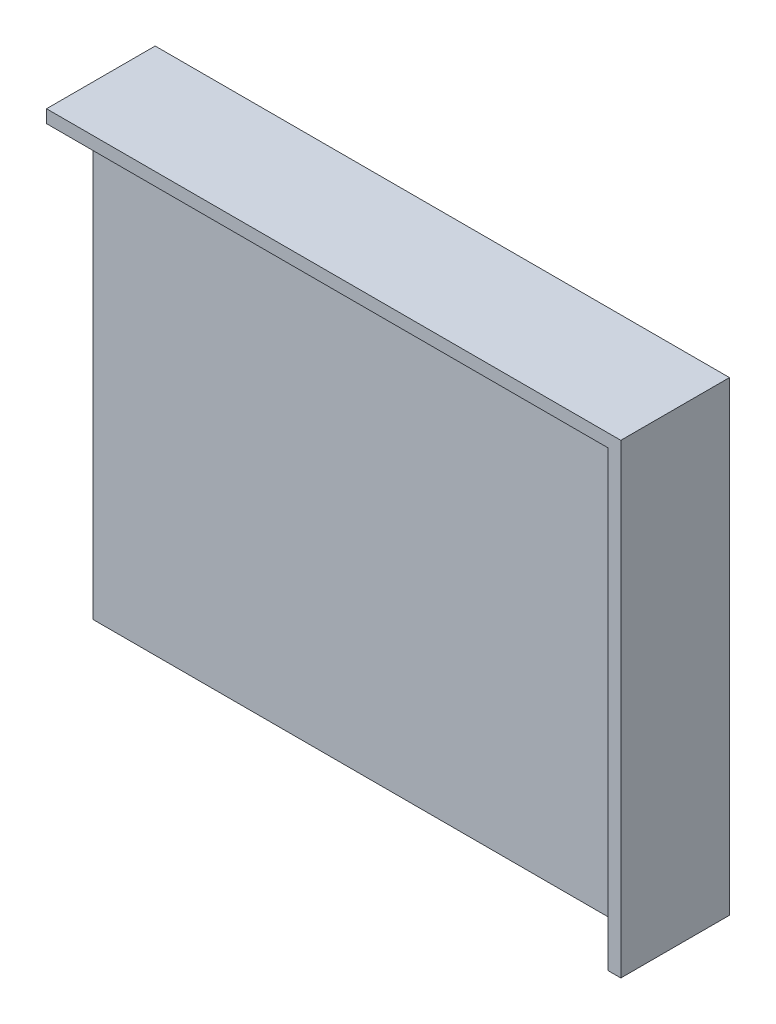
ISO-10303-21;
HEADER;
FILE_DESCRIPTION(('STEP AP214'),'2;1');
FILE_NAME('part.step','',(''),(''),'','','');
FILE_SCHEMA(('AUTOMOTIVE_DESIGN { 1 0 10303 214 1 1 1 1 }'));
ENDSEC;
DATA;
#1=APPLICATION_CONTEXT('core data for automotive mechanical design processes');
#2=APPLICATION_PROTOCOL_DEFINITION('international standard','automotive_design',2000,#1);
#3=PRODUCT_CONTEXT('',#1,'mechanical');
#4=PRODUCT('Part','Part','',(#3));
#5=PRODUCT_RELATED_PRODUCT_CATEGORY('part','',(#4));
#6=PRODUCT_DEFINITION_FORMATION('','',#4);
#7=PRODUCT_DEFINITION_CONTEXT('part definition',#1,'design');
#8=PRODUCT_DEFINITION('design','',#6,#7);
#9=PRODUCT_DEFINITION_SHAPE('','',#8);
#10=(LENGTH_UNIT() NAMED_UNIT(*) SI_UNIT(.MILLI.,.METRE.));
#11=(NAMED_UNIT(*) PLANE_ANGLE_UNIT() SI_UNIT($,.RADIAN.));
#12=(NAMED_UNIT(*) SI_UNIT($,.STERADIAN.) SOLID_ANGLE_UNIT());
#13=UNCERTAINTY_MEASURE_WITH_UNIT(LENGTH_MEASURE(1.E-05),#10,'distance_accuracy_value','');
#14=(GEOMETRIC_REPRESENTATION_CONTEXT(3) GLOBAL_UNCERTAINTY_ASSIGNED_CONTEXT((#13)) GLOBAL_UNIT_ASSIGNED_CONTEXT((#10,
#11,#12)) REPRESENTATION_CONTEXT('',''));
#15=CARTESIAN_POINT('',(0.,0.,0.));
#16=DIRECTION('',(0.,0.,1.));
#17=DIRECTION('',(1.,0.,0.));
#18=AXIS2_PLACEMENT_3D('',#15,#16,#17);
#19=CARTESIAN_POINT('',(213.576829268293,16.3396341463416,26.68));
#20=DIRECTION('',(0.,-1.,0.));
#21=DIRECTION('',(1.,0.,0.));
#22=AXIS2_PLACEMENT_3D('',#19,#20,#21);
#23=PLANE('',#22);
#24=DIRECTION('',(1.,0.,0.));
#25=VECTOR('',#24,1.);
#26=CARTESIAN_POINT('',(0.,16.3396341463416,2.54));
#27=LINE('',#26,#25);
#28=CARTESIAN_POINT('',(72.6068292682926,16.3396341463416,2.54));
#29=VERTEX_POINT('',#28);
#30=CARTESIAN_POINT('',(211.036829268293,16.3396341463416,2.54));
#31=VERTEX_POINT('',#30);
#32=EDGE_CURVE('E141',#29,#31,#27,.T.);
#33=ORIENTED_EDGE('',*,*,#32,.F.);
#34=DIRECTION('',(0.,0.,-1.));
#35=VECTOR('',#34,1.);
#36=CARTESIAN_POINT('',(72.6068292682926,16.3396341463416,26.68));
#37=LINE('',#36,#35);
#38=CARTESIAN_POINT('',(72.6068292682926,16.3396341463416,0.));
#39=VERTEX_POINT('',#38);
#40=EDGE_CURVE('E142',#29,#39,#37,.T.);
#41=ORIENTED_EDGE('',*,*,#40,.T.);
#42=DIRECTION('',(1.,0.,0.));
#43=VECTOR('',#42,1.);
#44=CARTESIAN_POINT('',(0.,16.3396341463416,0.));
#45=LINE('',#44,#43);
#46=CARTESIAN_POINT('',(213.576829268293,16.3396341463416,0.));
#47=VERTEX_POINT('',#46);
#48=EDGE_CURVE('E147',#39,#47,#45,.T.);
#49=ORIENTED_EDGE('',*,*,#48,.T.);
#50=DIRECTION('',(0.,0.,-1.));
#51=VECTOR('',#50,1.);
#52=CARTESIAN_POINT('',(213.576829268293,16.3396341463416,28.702));
#53=LINE('',#52,#51);
#54=CARTESIAN_POINT('',(213.576829268293,16.3396341463415,26.67));
#55=VERTEX_POINT('',#54);
#56=EDGE_CURVE('E181',#55,#47,#53,.T.);
#57=ORIENTED_EDGE('',*,*,#56,.F.);
#58=DIRECTION('',(1.,0.,0.));
#59=VECTOR('',#58,1.);
#60=CARTESIAN_POINT('',(0.,16.3396341463416,26.67));
#61=LINE('',#60,#59);
#62=CARTESIAN_POINT('',(210.401829268293,16.3396341463416,26.67));
#63=VERTEX_POINT('',#62);
#64=EDGE_CURVE('E156',#63,#55,#61,.T.);
#65=ORIENTED_EDGE('',*,*,#64,.F.);
#66=DIRECTION('',(0.,0.,1.));
#67=VECTOR('',#66,1.);
#68=CARTESIAN_POINT('',(210.401829268293,16.3396341463416,0.));
#69=LINE('',#68,#67);
#70=CARTESIAN_POINT('',(210.401829268293,16.3396341463416,15.24));
#71=VERTEX_POINT('',#70);
#72=EDGE_CURVE('E146',#71,#63,#69,.T.);
#73=ORIENTED_EDGE('',*,*,#72,.F.);
#74=DIRECTION('',(-1.,0.,0.));
#75=VECTOR('',#74,1.);
#76=CARTESIAN_POINT('',(0.,16.3396341463416,15.24));
#77=LINE('',#76,#75);
#78=CARTESIAN_POINT('',(72.6068292682926,16.3396341463416,15.24));
#79=VERTEX_POINT('',#78);
#80=EDGE_CURVE('E127',#71,#79,#77,.T.);
#81=ORIENTED_EDGE('',*,*,#80,.T.);
#82=CARTESIAN_POINT('',(72.6068292682926,16.3396341463416,12.7));
#83=VERTEX_POINT('',#82);
#84=EDGE_CURVE('E136',#79,#83,#37,.T.);
#85=ORIENTED_EDGE('',*,*,#84,.T.);
#86=DIRECTION('',(-1.,0.,0.));
#87=VECTOR('',#86,1.);
#88=CARTESIAN_POINT('',(0.,16.3396341463416,12.7));
#89=LINE('',#88,#87);
#90=CARTESIAN_POINT('',(211.036829268293,16.3396341463416,12.7));
#91=VERTEX_POINT('',#90);
#92=EDGE_CURVE('E184',#91,#83,#89,.T.);
#93=ORIENTED_EDGE('',*,*,#92,.F.);
#94=DIRECTION('',(0.,0.,-1.));
#95=VECTOR('',#94,1.);
#96=CARTESIAN_POINT('',(211.036829268293,16.3396341463416,28.702));
#97=LINE('',#96,#95);
#98=EDGE_CURVE('E150',#91,#31,#97,.T.);
#99=ORIENTED_EDGE('',*,*,#98,.T.);
#100=EDGE_LOOP('',(#33,#41,#49,#57,#65,#73,#81,#85,#93,#99));
#101=FACE_BOUND('',#100,.T.);
#102=ADVANCED_FACE('F40',(#101),#23,.T.);
#103=CARTESIAN_POINT('',(-68.3631707317074,128.099634146342,25.4));
#104=DIRECTION('',(0.,-1.,0.));
#105=DIRECTION('',(1.,0.,0.));
#106=AXIS2_PLACEMENT_3D('',#103,#104,#105);
#107=PLANE('',#106);
#108=DIRECTION('',(0.,0.,1.));
#109=VECTOR('',#108,1.);
#110=CARTESIAN_POINT('',(72.6068292682926,128.099634146342,25.4));
#111=LINE('',#110,#109);
#112=CARTESIAN_POINT('',(72.6068292682926,128.099634146342,2.54));
#113=VERTEX_POINT('',#112);
#114=CARTESIAN_POINT('',(72.6068292682926,128.099634146342,12.7));
#115=VERTEX_POINT('',#114);
#116=EDGE_CURVE('E158',#113,#115,#111,.T.);
#117=ORIENTED_EDGE('',*,*,#116,.F.);
#118=DIRECTION('',(-1.,0.,0.));
#119=VECTOR('',#118,1.);
#120=CARTESIAN_POINT('',(-68.3631707317074,128.099634146342,2.54));
#121=LINE('',#120,#119);
#122=CARTESIAN_POINT('',(211.036829268293,128.099634146342,2.54));
#123=VERTEX_POINT('',#122);
#124=EDGE_CURVE('E200',#123,#113,#121,.T.);
#125=ORIENTED_EDGE('',*,*,#124,.F.);
#126=DIRECTION('',(0.,0.,-1.));
#127=VECTOR('',#126,1.);
#128=CARTESIAN_POINT('',(211.036829268293,128.099634146342,28.702));
#129=LINE('',#128,#127);
#130=CARTESIAN_POINT('',(211.036829268293,128.099634146342,12.7));
#131=VERTEX_POINT('',#130);
#132=EDGE_CURVE('E164',#131,#123,#129,.T.);
#133=ORIENTED_EDGE('',*,*,#132,.F.);
#134=DIRECTION('',(-1.,0.,0.));
#135=VECTOR('',#134,1.);
#136=CARTESIAN_POINT('',(0.,128.099634146342,12.7));
#137=LINE('',#136,#135);
#138=EDGE_CURVE('E131',#131,#115,#137,.T.);
#139=ORIENTED_EDGE('',*,*,#138,.T.);
#140=EDGE_LOOP('',(#117,#125,#133,#139));
#141=FACE_BOUND('',#140,.T.);
#142=ADVANCED_FACE('F204',(#141),#107,.T.);
#143=CARTESIAN_POINT('',(0.,127.464634146342,0.));
#144=DIRECTION('',(0.,-1.,0.));
#145=DIRECTION('',(1.,0.,0.));
#146=AXIS2_PLACEMENT_3D('',#143,#144,#145);
#147=PLANE('',#146);
#148=DIRECTION('',(0.,0.,1.));
#149=VECTOR('',#148,1.);
#150=CARTESIAN_POINT('',(72.6068292682926,127.464634146342,0.));
#151=LINE('',#150,#149);
#152=CARTESIAN_POINT('',(72.6068292682926,127.464634146342,15.24));
#153=VERTEX_POINT('',#152);
#154=CARTESIAN_POINT('',(72.6068292682926,127.464634146342,26.67));
#155=VERTEX_POINT('',#154);
#156=EDGE_CURVE('E209',#153,#155,#151,.T.);
#157=ORIENTED_EDGE('',*,*,#156,.F.);
#158=DIRECTION('',(-1.,0.,0.));
#159=VECTOR('',#158,1.);
#160=CARTESIAN_POINT('',(-65.1881707317074,127.464634146342,15.24));
#161=LINE('',#160,#159);
#162=CARTESIAN_POINT('',(210.401829268293,127.464634146342,15.24));
#163=VERTEX_POINT('',#162);
#164=EDGE_CURVE('E129',#163,#153,#161,.T.);
#165=ORIENTED_EDGE('',*,*,#164,.F.);
#166=DIRECTION('',(0.,0.,1.));
#167=VECTOR('',#166,1.);
#168=CARTESIAN_POINT('',(210.401829268293,127.464634146342,36.83));
#169=LINE('',#168,#167);
#170=CARTESIAN_POINT('',(210.401829268293,127.464634146342,26.67));
#171=VERTEX_POINT('',#170);
#172=EDGE_CURVE('E170',#163,#171,#169,.T.);
#173=ORIENTED_EDGE('',*,*,#172,.T.);
#174=DIRECTION('',(1.,0.,0.));
#175=VECTOR('',#174,1.);
#176=CARTESIAN_POINT('',(-65.1881707317074,127.464634146342,26.67));
#177=LINE('',#176,#175);
#178=EDGE_CURVE('E11',#155,#171,#177,.T.);
#179=ORIENTED_EDGE('',*,*,#178,.F.);
#180=EDGE_LOOP('',(#157,#165,#173,#179));
#181=FACE_BOUND('',#180,.T.);
#182=ADVANCED_FACE('F223',(#181),#147,.T.);
#183=CARTESIAN_POINT('',(72.6068292682926,130.639634146342,26.68));
#184=DIRECTION('',(1.,0.,0.));
#185=DIRECTION('',(0.,1.,0.));
#186=AXIS2_PLACEMENT_3D('',#183,#184,#185);
#187=PLANE('',#186);
#188=ORIENTED_EDGE('',*,*,#84,.F.);
#189=DIRECTION('',(0.,-1.,0.));
#190=VECTOR('',#189,1.);
#191=CARTESIAN_POINT('',(72.6068292682926,0.,15.24));
#192=LINE('',#191,#190);
#193=EDGE_CURVE('E123',#153,#79,#192,.T.);
#194=ORIENTED_EDGE('',*,*,#193,.F.);
#195=ORIENTED_EDGE('',*,*,#156,.T.);
#196=DIRECTION('',(0.,1.,0.));
#197=VECTOR('',#196,1.);
#198=CARTESIAN_POINT('',(72.6068292682926,0.,26.67));
#199=LINE('',#198,#197);
#200=CARTESIAN_POINT('',(72.6068292682926,130.639634146342,26.67));
#201=VERTEX_POINT('',#200);
#202=EDGE_CURVE('E206',#155,#201,#199,.T.);
#203=ORIENTED_EDGE('',*,*,#202,.T.);
#204=DIRECTION('',(0.,0.,1.));
#205=VECTOR('',#204,1.);
#206=CARTESIAN_POINT('',(72.6068292682926,130.639634146342,25.4));
#207=LINE('',#206,#205);
#208=CARTESIAN_POINT('',(72.6068292682926,130.639634146342,0.));
#209=VERTEX_POINT('',#208);
#210=EDGE_CURVE('E159',#209,#201,#207,.T.);
#211=ORIENTED_EDGE('',*,*,#210,.F.);
#212=DIRECTION('',(0.,1.,0.));
#213=VECTOR('',#212,1.);
#214=CARTESIAN_POINT('',(72.6068292682926,0.,0.));
#215=LINE('',#214,#213);
#216=EDGE_CURVE('E132',#39,#209,#215,.T.);
#217=ORIENTED_EDGE('',*,*,#216,.F.);
#218=ORIENTED_EDGE('',*,*,#40,.F.);
#219=DIRECTION('',(0.,1.,0.));
#220=VECTOR('',#219,1.);
#221=CARTESIAN_POINT('',(72.6068292682926,0.,2.54));
#222=LINE('',#221,#220);
#223=EDGE_CURVE('E155',#29,#113,#222,.T.);
#224=ORIENTED_EDGE('',*,*,#223,.T.);
#225=ORIENTED_EDGE('',*,*,#116,.T.);
#226=DIRECTION('',(0.,-1.,0.));
#227=VECTOR('',#226,1.);
#228=CARTESIAN_POINT('',(72.6068292682926,0.,12.7));
#229=LINE('',#228,#227);
#230=EDGE_CURVE('E139',#115,#83,#229,.T.);
#231=ORIENTED_EDGE('',*,*,#230,.T.);
#232=EDGE_LOOP('',(#188,#194,#195,#203,#211,#217,#218,#224,#225,#231));
#233=FACE_BOUND('',#232,.T.);
#234=ADVANCED_FACE('F137',(#233),#187,.F.);
#235=CARTESIAN_POINT('',(-68.3631707317074,130.639634146342,25.4));
#236=DIRECTION('',(0.,-1.,0.));
#237=DIRECTION('',(1.,0.,0.));
#238=AXIS2_PLACEMENT_3D('',#235,#236,#237);
#239=PLANE('',#238);
#240=DIRECTION('',(-1.,0.,0.));
#241=VECTOR('',#240,1.);
#242=CARTESIAN_POINT('',(-68.3631707317074,130.639634146342,0.));
#243=LINE('',#242,#241);
#244=CARTESIAN_POINT('',(213.576829268293,130.639634146342,0.));
#245=VERTEX_POINT('',#244);
#246=EDGE_CURVE('E171',#245,#209,#243,.T.);
#247=ORIENTED_EDGE('',*,*,#246,.T.);
#248=ORIENTED_EDGE('',*,*,#210,.T.);
#249=DIRECTION('',(-1.,0.,0.));
#250=VECTOR('',#249,1.);
#251=CARTESIAN_POINT('',(213.576829268293,130.639634146342,26.67));
#252=LINE('',#251,#250);
#253=CARTESIAN_POINT('',(213.576829268293,130.639634146342,26.67));
#254=VERTEX_POINT('',#253);
#255=EDGE_CURVE('E172',#254,#201,#252,.T.);
#256=ORIENTED_EDGE('',*,*,#255,.F.);
#257=DIRECTION('',(0.,0.,-1.));
#258=VECTOR('',#257,1.);
#259=CARTESIAN_POINT('',(213.576829268293,130.639634146342,25.4));
#260=LINE('',#259,#258);
#261=EDGE_CURVE('E167',#254,#245,#260,.T.);
#262=ORIENTED_EDGE('',*,*,#261,.T.);
#263=EDGE_LOOP('',(#247,#248,#256,#262));
#264=FACE_BOUND('',#263,.T.);
#265=ADVANCED_FACE('F231',(#264),#239,.F.);
#266=CARTESIAN_POINT('',(213.576829268293,-94.7853658536585,28.702));
#267=DIRECTION('',(1.,0.,0.));
#268=DIRECTION('',(0.,0.,-1.));
#269=AXIS2_PLACEMENT_3D('',#266,#267,#268);
#270=PLANE('',#269);
#271=DIRECTION('',(0.,1.,0.));
#272=VECTOR('',#271,1.);
#273=CARTESIAN_POINT('',(213.576829268293,-80.4343658536585,26.67));
#274=LINE('',#273,#272);
#275=EDGE_CURVE('E56',#55,#254,#274,.T.);
#276=ORIENTED_EDGE('',*,*,#275,.F.);
#277=ORIENTED_EDGE('',*,*,#56,.T.);
#278=DIRECTION('',(0.,1.,0.));
#279=VECTOR('',#278,1.);
#280=CARTESIAN_POINT('',(213.576829268293,130.639634146342,0.));
#281=LINE('',#280,#279);
#282=EDGE_CURVE('E168',#47,#245,#281,.T.);
#283=ORIENTED_EDGE('',*,*,#282,.T.);
#284=ORIENTED_EDGE('',*,*,#261,.F.);
#285=EDGE_LOOP('',(#276,#277,#283,#284));
#286=FACE_BOUND('',#285,.T.);
#287=ADVANCED_FACE('F237',(#286),#270,.T.);
#288=CARTESIAN_POINT('',(210.401829268293,0.,0.));
#289=DIRECTION('',(-1.,0.,0.));
#290=DIRECTION('',(0.,0.,1.));
#291=AXIS2_PLACEMENT_3D('',#288,#289,#290);
#292=PLANE('',#291);
#293=DIRECTION('',(0.,1.,0.));
#294=VECTOR('',#293,1.);
#295=CARTESIAN_POINT('',(210.401829268293,127.464634146342,15.24));
#296=LINE('',#295,#294);
#297=EDGE_CURVE('E64',#71,#163,#296,.T.);
#298=ORIENTED_EDGE('',*,*,#297,.F.);
#299=ORIENTED_EDGE('',*,*,#72,.T.);
#300=DIRECTION('',(0.,-1.,0.));
#301=VECTOR('',#300,1.);
#302=CARTESIAN_POINT('',(210.401829268293,127.464634146342,26.67));
#303=LINE('',#302,#301);
#304=EDGE_CURVE('E44',#171,#63,#303,.T.);
#305=ORIENTED_EDGE('',*,*,#304,.F.);
#306=ORIENTED_EDGE('',*,*,#172,.F.);
#307=EDGE_LOOP('',(#298,#299,#305,#306));
#308=FACE_BOUND('',#307,.T.);
#309=ADVANCED_FACE('F226',(#308),#292,.T.);
#310=CARTESIAN_POINT('',(0.,0.,26.67));
#311=DIRECTION('',(0.,0.,1.));
#312=DIRECTION('',(1.,0.,0.));
#313=AXIS2_PLACEMENT_3D('',#310,#311,#312);
#314=PLANE('',#313);
#315=ORIENTED_EDGE('',*,*,#304,.T.);
#316=ORIENTED_EDGE('',*,*,#64,.T.);
#317=ORIENTED_EDGE('',*,*,#275,.T.);
#318=ORIENTED_EDGE('',*,*,#255,.T.);
#319=ORIENTED_EDGE('',*,*,#202,.F.);
#320=ORIENTED_EDGE('',*,*,#178,.T.);
#321=EDGE_LOOP('',(#315,#316,#317,#318,#319,#320));
#322=FACE_BOUND('',#321,.T.);
#323=ADVANCED_FACE('F42',(#322),#314,.T.);
#324=CARTESIAN_POINT('',(0.,0.,15.24));
#325=DIRECTION('',(0.,0.,-1.));
#326=DIRECTION('',(-1.,0.,0.));
#327=AXIS2_PLACEMENT_3D('',#324,#325,#326);
#328=PLANE('',#327);
#329=ORIENTED_EDGE('',*,*,#80,.F.);
#330=ORIENTED_EDGE('',*,*,#297,.T.);
#331=ORIENTED_EDGE('',*,*,#164,.T.);
#332=ORIENTED_EDGE('',*,*,#193,.T.);
#333=EDGE_LOOP('',(#329,#330,#331,#332));
#334=FACE_BOUND('',#333,.T.);
#335=ADVANCED_FACE('F125',(#334),#328,.F.);
#336=CARTESIAN_POINT('',(0.,0.,0.));
#337=DIRECTION('',(0.,0.,1.));
#338=DIRECTION('',(1.,0.,0.));
#339=AXIS2_PLACEMENT_3D('',#336,#337,#338);
#340=PLANE('',#339);
#341=ORIENTED_EDGE('',*,*,#48,.F.);
#342=ORIENTED_EDGE('',*,*,#216,.T.);
#343=ORIENTED_EDGE('',*,*,#246,.F.);
#344=ORIENTED_EDGE('',*,*,#282,.F.);
#345=EDGE_LOOP('',(#341,#342,#343,#344));
#346=FACE_BOUND('',#345,.T.);
#347=ADVANCED_FACE('F235',(#346),#340,.F.);
#348=CARTESIAN_POINT('',(211.036829268293,-94.7853658536585,28.702));
#349=DIRECTION('',(1.,0.,0.));
#350=DIRECTION('',(0.,0.,-1.));
#351=AXIS2_PLACEMENT_3D('',#348,#349,#350);
#352=PLANE('',#351);
#353=ORIENTED_EDGE('',*,*,#98,.F.);
#354=DIRECTION('',(0.,-1.,0.));
#355=VECTOR('',#354,1.);
#356=CARTESIAN_POINT('',(211.036829268293,0.,12.7));
#357=LINE('',#356,#355);
#358=EDGE_CURVE('E163',#131,#91,#357,.T.);
#359=ORIENTED_EDGE('',*,*,#358,.F.);
#360=ORIENTED_EDGE('',*,*,#132,.T.);
#361=DIRECTION('',(0.,1.,0.));
#362=VECTOR('',#361,1.);
#363=CARTESIAN_POINT('',(211.036829268293,0.,2.54));
#364=LINE('',#363,#362);
#365=EDGE_CURVE('E161',#31,#123,#364,.T.);
#366=ORIENTED_EDGE('',*,*,#365,.F.);
#367=EDGE_LOOP('',(#353,#359,#360,#366));
#368=FACE_BOUND('',#367,.T.);
#369=ADVANCED_FACE('F193',(#368),#352,.F.);
#370=CARTESIAN_POINT('',(0.,0.,12.7));
#371=DIRECTION('',(0.,0.,-1.));
#372=DIRECTION('',(-1.,0.,0.));
#373=AXIS2_PLACEMENT_3D('',#370,#371,#372);
#374=PLANE('',#373);
#375=ORIENTED_EDGE('',*,*,#358,.T.);
#376=ORIENTED_EDGE('',*,*,#92,.T.);
#377=ORIENTED_EDGE('',*,*,#230,.F.);
#378=ORIENTED_EDGE('',*,*,#138,.F.);
#379=EDGE_LOOP('',(#375,#376,#377,#378));
#380=FACE_BOUND('',#379,.T.);
#381=ADVANCED_FACE('F260',(#380),#374,.T.);
#382=CARTESIAN_POINT('',(0.,0.,2.54));
#383=DIRECTION('',(0.,0.,1.));
#384=DIRECTION('',(1.,0.,0.));
#385=AXIS2_PLACEMENT_3D('',#382,#383,#384);
#386=PLANE('',#385);
#387=ORIENTED_EDGE('',*,*,#223,.F.);
#388=ORIENTED_EDGE('',*,*,#32,.T.);
#389=ORIENTED_EDGE('',*,*,#365,.T.);
#390=ORIENTED_EDGE('',*,*,#124,.T.);
#391=EDGE_LOOP('',(#387,#388,#389,#390));
#392=FACE_BOUND('',#391,.T.);
#393=ADVANCED_FACE('F199',(#392),#386,.T.);
#394=CLOSED_SHELL('',(#102,#142,#182,#234,#265,#287,#309,#323,#335,#347,#369,#381,#393));
#395=MANIFOLD_SOLID_BREP('B2',#394);
#396=ADVANCED_BREP_SHAPE_REPRESENTATION('',(#18,#395),#14);
#397=SHAPE_DEFINITION_REPRESENTATION(#9,#396);
ENDSEC;
END-ISO-10303-21;
